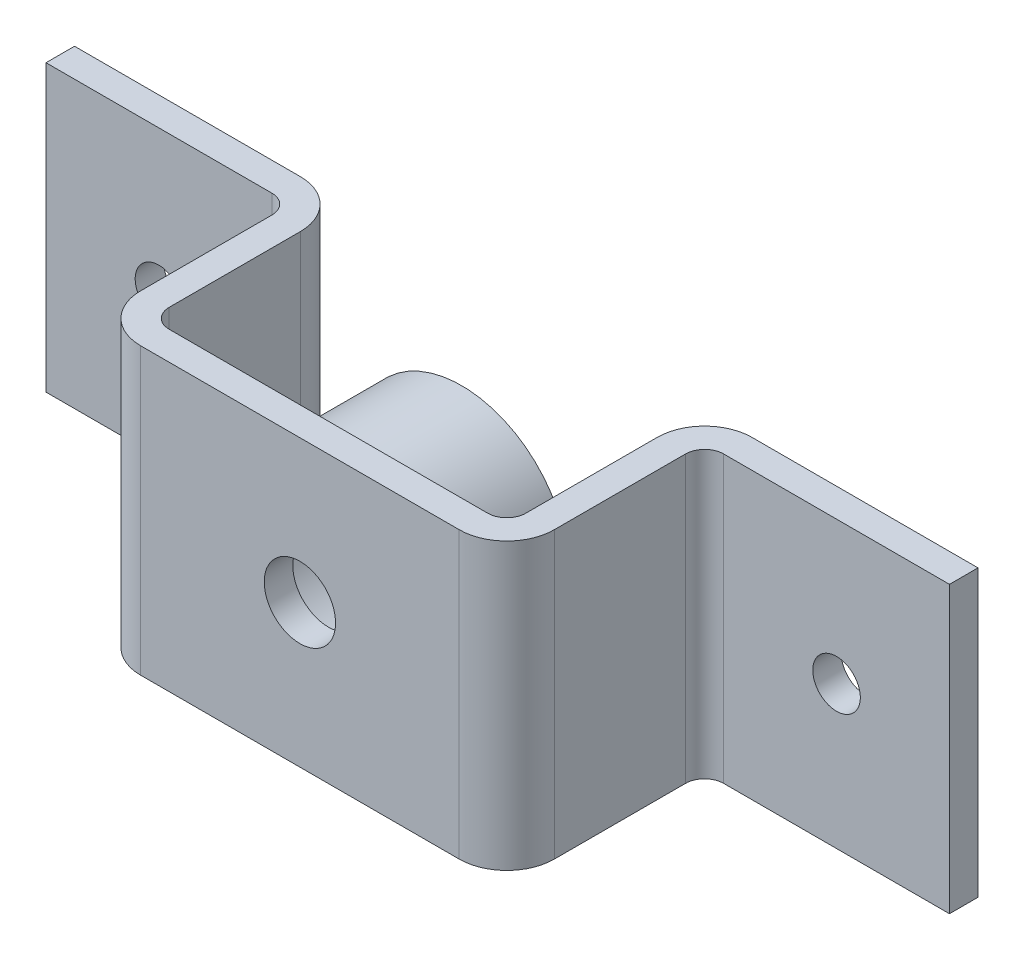
ISO-10303-21;
HEADER;
FILE_DESCRIPTION(('STEP AP214'),'2;1');
FILE_NAME('part.step','',(''),(''),'','','');
FILE_SCHEMA(('AUTOMOTIVE_DESIGN { 1 0 10303 214 1 1 1 1 }'));
ENDSEC;
DATA;
#1=APPLICATION_CONTEXT('core data for automotive mechanical design processes');
#2=APPLICATION_PROTOCOL_DEFINITION('international standard','automotive_design',2000,#1);
#3=PRODUCT_CONTEXT('',#1,'mechanical');
#4=PRODUCT('Part','Part','',(#3));
#5=PRODUCT_RELATED_PRODUCT_CATEGORY('part','',(#4));
#6=PRODUCT_DEFINITION_FORMATION('','',#4);
#7=PRODUCT_DEFINITION_CONTEXT('part definition',#1,'design');
#8=PRODUCT_DEFINITION('design','',#6,#7);
#9=PRODUCT_DEFINITION_SHAPE('','',#8);
#10=(LENGTH_UNIT() NAMED_UNIT(*) SI_UNIT(.MILLI.,.METRE.));
#11=(NAMED_UNIT(*) PLANE_ANGLE_UNIT() SI_UNIT($,.RADIAN.));
#12=(NAMED_UNIT(*) SI_UNIT($,.STERADIAN.) SOLID_ANGLE_UNIT());
#13=UNCERTAINTY_MEASURE_WITH_UNIT(LENGTH_MEASURE(1.E-05),#10,'distance_accuracy_value','');
#14=(GEOMETRIC_REPRESENTATION_CONTEXT(3) GLOBAL_UNCERTAINTY_ASSIGNED_CONTEXT((#13)) GLOBAL_UNIT_ASSIGNED_CONTEXT((#10,
#11,#12)) REPRESENTATION_CONTEXT('',''));
#15=CARTESIAN_POINT('',(0.,0.,0.));
#16=DIRECTION('',(0.,0.,1.));
#17=DIRECTION('',(1.,0.,0.));
#18=AXIS2_PLACEMENT_3D('',#15,#16,#17);
#19=CARTESIAN_POINT('',(0.,0.,-238.));
#20=DIRECTION('',(0.,0.,-1.));
#21=DIRECTION('',(-1.,0.,0.));
#22=AXIS2_PLACEMENT_3D('',#19,#20,#21);
#23=PLANE('',#22);
#24=CARTESIAN_POINT('',(356.25,0.,-238.));
#25=DIRECTION('',(0.,0.,-1.));
#26=DIRECTION('',(-1.,0.,0.));
#27=AXIS2_PLACEMENT_3D('',#24,#25,#26);
#28=CIRCLE('',#27,25.);
#29=CARTESIAN_POINT('',(331.25,0.,-238.));
#30=VERTEX_POINT('',#29);
#31=EDGE_CURVE('E290',#30,#30,#28,.T.);
#32=ORIENTED_EDGE('',*,*,#31,.F.);
#33=EDGE_LOOP('',(#32));
#34=FACE_BOUND('',#33,.T.);
#35=DIRECTION('',(1.,0.,0.));
#36=VECTOR('',#35,1.);
#37=CARTESIAN_POINT('',(-475.,-150.,-238.));
#38=LINE('',#37,#36);
#39=CARTESIAN_POINT('',(237.5,-150.,-238.));
#40=VERTEX_POINT('',#39);
#41=CARTESIAN_POINT('',(475.,-150.,-238.));
#42=VERTEX_POINT('',#41);
#43=EDGE_CURVE('E353',#40,#42,#38,.T.);
#44=ORIENTED_EDGE('',*,*,#43,.F.);
#45=DIRECTION('',(0.,-1.,0.));
#46=VECTOR('',#45,1.);
#47=CARTESIAN_POINT('',(237.5,150.,-238.));
#48=LINE('',#47,#46);
#49=CARTESIAN_POINT('',(237.5,150.,-238.));
#50=VERTEX_POINT('',#49);
#51=EDGE_CURVE('E283',#40,#50,#48,.F.);
#52=ORIENTED_EDGE('',*,*,#51,.T.);
#53=DIRECTION('',(-1.,0.,0.));
#54=VECTOR('',#53,1.);
#55=CARTESIAN_POINT('',(-475.,150.,-238.));
#56=LINE('',#55,#54);
#57=CARTESIAN_POINT('',(475.,150.,-238.));
#58=VERTEX_POINT('',#57);
#59=EDGE_CURVE('E349',#58,#50,#56,.T.);
#60=ORIENTED_EDGE('',*,*,#59,.F.);
#61=DIRECTION('',(0.,1.,0.));
#62=VECTOR('',#61,1.);
#63=CARTESIAN_POINT('',(475.,-150.,-238.));
#64=LINE('',#63,#62);
#65=EDGE_CURVE('E344',#42,#58,#64,.T.);
#66=ORIENTED_EDGE('',*,*,#65,.F.);
#67=EDGE_LOOP('',(#44,#52,#60,#66));
#68=FACE_BOUND('',#67,.T.);
#69=ADVANCED_FACE('F33',(#34,#68),#23,.T.);
#70=CARTESIAN_POINT('',(475.,-150.,-238.));
#71=DIRECTION('',(1.,0.,0.));
#72=DIRECTION('',(0.,0.,-1.));
#73=AXIS2_PLACEMENT_3D('',#70,#71,#72);
#74=PLANE('',#73);
#75=DIRECTION('',(0.,-1.,0.));
#76=VECTOR('',#75,1.);
#77=CARTESIAN_POINT('',(475.,155.,-208.));
#78=LINE('',#77,#76);
#79=CARTESIAN_POINT('',(475.,150.,-208.));
#80=VERTEX_POINT('',#79);
#81=CARTESIAN_POINT('',(475.,-150.,-208.));
#82=VERTEX_POINT('',#81);
#83=EDGE_CURVE('E321',#80,#82,#78,.T.);
#84=ORIENTED_EDGE('',*,*,#83,.T.);
#85=DIRECTION('',(0.,0.,1.));
#86=VECTOR('',#85,1.);
#87=CARTESIAN_POINT('',(475.,-150.,-238.));
#88=LINE('',#87,#86);
#89=EDGE_CURVE('E200',#42,#82,#88,.T.);
#90=ORIENTED_EDGE('',*,*,#89,.F.);
#91=ORIENTED_EDGE('',*,*,#65,.T.);
#92=DIRECTION('',(0.,0.,1.));
#93=VECTOR('',#92,1.);
#94=CARTESIAN_POINT('',(475.,150.,-238.));
#95=LINE('',#94,#93);
#96=EDGE_CURVE('E206',#58,#80,#95,.T.);
#97=ORIENTED_EDGE('',*,*,#96,.T.);
#98=EDGE_LOOP('',(#84,#90,#91,#97));
#99=FACE_BOUND('',#98,.T.);
#100=ADVANCED_FACE('F383',(#99),#74,.T.);
#101=CARTESIAN_POINT('',(-475.,-150.,-238.));
#102=DIRECTION('',(0.,-1.,0.));
#103=DIRECTION('',(0.,0.,-1.));
#104=AXIS2_PLACEMENT_3D('',#101,#102,#103);
#105=PLANE('',#104);
#106=DIRECTION('',(1.,0.,0.));
#107=VECTOR('',#106,1.);
#108=CARTESIAN_POINT('',(-475.,-150.,0.));
#109=LINE('',#108,#107);
#110=CARTESIAN_POINT('',(-167.5,-150.,0.));
#111=VERTEX_POINT('',#110);
#112=CARTESIAN_POINT('',(167.5,-150.,0.));
#113=VERTEX_POINT('',#112);
#114=EDGE_CURVE('E348',#111,#113,#109,.T.);
#115=ORIENTED_EDGE('',*,*,#114,.F.);
#116=CARTESIAN_POINT('',(-167.5,-150.,-50.));
#117=DIRECTION('',(0.,-1.,0.));
#118=DIRECTION('',(0.,0.,-1.));
#119=AXIS2_PLACEMENT_3D('',#116,#117,#118);
#120=CIRCLE('',#119,50.);
#121=CARTESIAN_POINT('',(-217.5,-150.,-50.));
#122=VERTEX_POINT('',#121);
#123=EDGE_CURVE('E267',#111,#122,#120,.T.);
#124=ORIENTED_EDGE('',*,*,#123,.T.);
#125=DIRECTION('',(0.,0.,1.));
#126=VECTOR('',#125,1.);
#127=CARTESIAN_POINT('',(-217.5,-150.,0.));
#128=LINE('',#127,#126);
#129=CARTESIAN_POINT('',(-217.5,-150.,-188.));
#130=VERTEX_POINT('',#129);
#131=EDGE_CURVE('E184',#130,#122,#128,.T.);
#132=ORIENTED_EDGE('',*,*,#131,.F.);
#133=CARTESIAN_POINT('',(-237.5,-150.,-188.));
#134=DIRECTION('',(0.,-1.,0.));
#135=DIRECTION('',(0.,0.,-1.));
#136=AXIS2_PLACEMENT_3D('',#133,#134,#135);
#137=CIRCLE('',#136,20.);
#138=CARTESIAN_POINT('',(-237.5,-150.,-208.));
#139=VERTEX_POINT('',#138);
#140=EDGE_CURVE('E193',#130,#139,#137,.F.);
#141=ORIENTED_EDGE('',*,*,#140,.T.);
#142=DIRECTION('',(1.,0.,0.));
#143=VECTOR('',#142,1.);
#144=CARTESIAN_POINT('',(-475.,-150.,-208.));
#145=LINE('',#144,#143);
#146=CARTESIAN_POINT('',(-475.,-150.,-208.));
#147=VERTEX_POINT('',#146);
#148=EDGE_CURVE('E175',#147,#139,#145,.T.);
#149=ORIENTED_EDGE('',*,*,#148,.F.);
#150=DIRECTION('',(0.,0.,1.));
#151=VECTOR('',#150,1.);
#152=CARTESIAN_POINT('',(-475.,-150.,-238.));
#153=LINE('',#152,#151);
#154=CARTESIAN_POINT('',(-475.,-150.,-238.));
#155=VERTEX_POINT('',#154);
#156=EDGE_CURVE('E190',#155,#147,#153,.T.);
#157=ORIENTED_EDGE('',*,*,#156,.F.);
#158=CARTESIAN_POINT('',(-237.5,-150.,-238.));
#159=VERTEX_POINT('',#158);
#160=EDGE_CURVE('E212',#155,#159,#38,.T.);
#161=ORIENTED_EDGE('',*,*,#160,.T.);
#162=CARTESIAN_POINT('',(-237.5,-150.,-188.));
#163=DIRECTION('',(0.,-1.,0.));
#164=DIRECTION('',(0.,0.,-1.));
#165=AXIS2_PLACEMENT_3D('',#162,#163,#164);
#166=CIRCLE('',#165,50.);
#167=CARTESIAN_POINT('',(-187.5,-150.,-188.));
#168=VERTEX_POINT('',#167);
#169=EDGE_CURVE('E261',#159,#168,#166,.T.);
#170=ORIENTED_EDGE('',*,*,#169,.T.);
#171=DIRECTION('',(0.,0.,-1.));
#172=VECTOR('',#171,1.);
#173=CARTESIAN_POINT('',(-187.5,-150.,-238.));
#174=LINE('',#173,#172);
#175=CARTESIAN_POINT('',(-187.5,-150.,-50.));
#176=VERTEX_POINT('',#175);
#177=EDGE_CURVE('E335',#176,#168,#174,.T.);
#178=ORIENTED_EDGE('',*,*,#177,.F.);
#179=CARTESIAN_POINT('',(-167.5,-150.,-50.));
#180=DIRECTION('',(0.,-1.,0.));
#181=DIRECTION('',(0.,0.,-1.));
#182=AXIS2_PLACEMENT_3D('',#179,#180,#181);
#183=CIRCLE('',#182,20.);
#184=CARTESIAN_POINT('',(-167.5,-150.,-30.));
#185=VERTEX_POINT('',#184);
#186=EDGE_CURVE('E253',#176,#185,#183,.F.);
#187=ORIENTED_EDGE('',*,*,#186,.T.);
#188=DIRECTION('',(-1.,0.,0.));
#189=VECTOR('',#188,1.);
#190=CARTESIAN_POINT('',(-475.,-150.,-30.));
#191=LINE('',#190,#189);
#192=CARTESIAN_POINT('',(167.5,-150.,-30.));
#193=VERTEX_POINT('',#192);
#194=EDGE_CURVE('E340',#193,#185,#191,.T.);
#195=ORIENTED_EDGE('',*,*,#194,.F.);
#196=CARTESIAN_POINT('',(167.5,-150.,-50.));
#197=DIRECTION('',(0.,-1.,0.));
#198=DIRECTION('',(0.,0.,-1.));
#199=AXIS2_PLACEMENT_3D('',#196,#197,#198);
#200=CIRCLE('',#199,20.);
#201=CARTESIAN_POINT('',(187.5,-150.,-50.));
#202=VERTEX_POINT('',#201);
#203=EDGE_CURVE('E247',#193,#202,#200,.F.);
#204=ORIENTED_EDGE('',*,*,#203,.T.);
#205=DIRECTION('',(0.,0.,1.));
#206=VECTOR('',#205,1.);
#207=CARTESIAN_POINT('',(187.5,-150.,-238.));
#208=LINE('',#207,#206);
#209=CARTESIAN_POINT('',(187.5,-150.,-188.));
#210=VERTEX_POINT('',#209);
#211=EDGE_CURVE('E338',#210,#202,#208,.T.);
#212=ORIENTED_EDGE('',*,*,#211,.F.);
#213=CARTESIAN_POINT('',(237.5,-150.,-188.));
#214=DIRECTION('',(0.,-1.,0.));
#215=DIRECTION('',(0.,0.,-1.));
#216=AXIS2_PLACEMENT_3D('',#213,#214,#215);
#217=CIRCLE('',#216,50.);
#218=EDGE_CURVE('E263',#210,#40,#217,.T.);
#219=ORIENTED_EDGE('',*,*,#218,.T.);
#220=ORIENTED_EDGE('',*,*,#43,.T.);
#221=ORIENTED_EDGE('',*,*,#89,.T.);
#222=DIRECTION('',(1.,0.,0.));
#223=VECTOR('',#222,1.);
#224=CARTESIAN_POINT('',(475.,-150.,-208.));
#225=LINE('',#224,#223);
#226=CARTESIAN_POINT('',(237.5,-150.,-208.));
#227=VERTEX_POINT('',#226);
#228=EDGE_CURVE('E319',#227,#82,#225,.T.);
#229=ORIENTED_EDGE('',*,*,#228,.F.);
#230=CARTESIAN_POINT('',(237.5,-150.,-188.));
#231=DIRECTION('',(0.,-1.,0.));
#232=DIRECTION('',(0.,0.,-1.));
#233=AXIS2_PLACEMENT_3D('',#230,#231,#232);
#234=CIRCLE('',#233,20.);
#235=CARTESIAN_POINT('',(217.5,-150.,-188.));
#236=VERTEX_POINT('',#235);
#237=EDGE_CURVE('E236',#227,#236,#234,.F.);
#238=ORIENTED_EDGE('',*,*,#237,.T.);
#239=DIRECTION('',(0.,0.,-1.));
#240=VECTOR('',#239,1.);
#241=CARTESIAN_POINT('',(217.5,-150.,0.));
#242=LINE('',#241,#240);
#243=CARTESIAN_POINT('',(217.5,-150.,-50.));
#244=VERTEX_POINT('',#243);
#245=EDGE_CURVE('E317',#244,#236,#242,.T.);
#246=ORIENTED_EDGE('',*,*,#245,.F.);
#247=CARTESIAN_POINT('',(167.5,-150.,-50.));
#248=DIRECTION('',(0.,-1.,0.));
#249=DIRECTION('',(0.,0.,-1.));
#250=AXIS2_PLACEMENT_3D('',#247,#248,#249);
#251=CIRCLE('',#250,50.);
#252=EDGE_CURVE('E265',#244,#113,#251,.T.);
#253=ORIENTED_EDGE('',*,*,#252,.T.);
#254=EDGE_LOOP('',(#115,#124,#132,#141,#149,#157,#161,#170,#178,#187,#195,#204,#212,#219,#220,
#221,#229,#238,#246,#253));
#255=FACE_BOUND('',#254,.T.);
#256=ADVANCED_FACE('F188',(#255),#105,.T.);
#257=CARTESIAN_POINT('',(-475.,-150.,-238.));
#258=DIRECTION('',(-1.,0.,0.));
#259=DIRECTION('',(0.,0.,1.));
#260=AXIS2_PLACEMENT_3D('',#257,#258,#259);
#261=PLANE('',#260);
#262=DIRECTION('',(0.,-1.,0.));
#263=VECTOR('',#262,1.);
#264=CARTESIAN_POINT('',(-475.,155.,-208.));
#265=LINE('',#264,#263);
#266=CARTESIAN_POINT('',(-475.,150.,-208.));
#267=VERTEX_POINT('',#266);
#268=EDGE_CURVE('E172',#267,#147,#265,.T.);
#269=ORIENTED_EDGE('',*,*,#268,.F.);
#270=DIRECTION('',(0.,0.,1.));
#271=VECTOR('',#270,1.);
#272=CARTESIAN_POINT('',(-475.,150.,-238.));
#273=LINE('',#272,#271);
#274=CARTESIAN_POINT('',(-475.,150.,-238.));
#275=VERTEX_POINT('',#274);
#276=EDGE_CURVE('E201',#275,#267,#273,.T.);
#277=ORIENTED_EDGE('',*,*,#276,.F.);
#278=DIRECTION('',(0.,-1.,0.));
#279=VECTOR('',#278,1.);
#280=CARTESIAN_POINT('',(-475.,-150.,-238.));
#281=LINE('',#280,#279);
#282=EDGE_CURVE('E198',#275,#155,#281,.T.);
#283=ORIENTED_EDGE('',*,*,#282,.T.);
#284=ORIENTED_EDGE('',*,*,#156,.T.);
#285=EDGE_LOOP('',(#269,#277,#283,#284));
#286=FACE_BOUND('',#285,.T.);
#287=ADVANCED_FACE('F196',(#286),#261,.T.);
#288=CARTESIAN_POINT('',(-475.,150.,-238.));
#289=DIRECTION('',(0.,1.,0.));
#290=DIRECTION('',(0.,0.,1.));
#291=AXIS2_PLACEMENT_3D('',#288,#289,#290);
#292=PLANE('',#291);
#293=DIRECTION('',(0.,0.,-1.));
#294=VECTOR('',#293,1.);
#295=CARTESIAN_POINT('',(-217.5,150.,-238.));
#296=LINE('',#295,#294);
#297=CARTESIAN_POINT('',(-217.5,150.,-50.));
#298=VERTEX_POINT('',#297);
#299=CARTESIAN_POINT('',(-217.5,150.,-188.));
#300=VERTEX_POINT('',#299);
#301=EDGE_CURVE('E183',#298,#300,#296,.T.);
#302=ORIENTED_EDGE('',*,*,#301,.F.);
#303=CARTESIAN_POINT('',(-167.5,150.,-50.));
#304=DIRECTION('',(0.,1.,0.));
#305=DIRECTION('',(0.,0.,1.));
#306=AXIS2_PLACEMENT_3D('',#303,#304,#305);
#307=CIRCLE('',#306,50.);
#308=CARTESIAN_POINT('',(-167.5,150.,0.));
#309=VERTEX_POINT('',#308);
#310=EDGE_CURVE('E276',#298,#309,#307,.T.);
#311=ORIENTED_EDGE('',*,*,#310,.T.);
#312=DIRECTION('',(-1.,0.,0.));
#313=VECTOR('',#312,1.);
#314=CARTESIAN_POINT('',(-475.,150.,0.));
#315=LINE('',#314,#313);
#316=CARTESIAN_POINT('',(167.5,150.,0.));
#317=VERTEX_POINT('',#316);
#318=EDGE_CURVE('E343',#317,#309,#315,.T.);
#319=ORIENTED_EDGE('',*,*,#318,.F.);
#320=CARTESIAN_POINT('',(167.5,150.,-50.));
#321=DIRECTION('',(0.,1.,0.));
#322=DIRECTION('',(0.,0.,1.));
#323=AXIS2_PLACEMENT_3D('',#320,#321,#322);
#324=CIRCLE('',#323,50.);
#325=CARTESIAN_POINT('',(217.5,150.,-50.));
#326=VERTEX_POINT('',#325);
#327=EDGE_CURVE('E274',#317,#326,#324,.T.);
#328=ORIENTED_EDGE('',*,*,#327,.T.);
#329=DIRECTION('',(0.,0.,1.));
#330=VECTOR('',#329,1.);
#331=CARTESIAN_POINT('',(217.5,150.,-238.));
#332=LINE('',#331,#330);
#333=CARTESIAN_POINT('',(217.5,150.,-188.));
#334=VERTEX_POINT('',#333);
#335=EDGE_CURVE('E324',#334,#326,#332,.T.);
#336=ORIENTED_EDGE('',*,*,#335,.F.);
#337=CARTESIAN_POINT('',(237.5,150.,-188.));
#338=DIRECTION('',(0.,1.,0.));
#339=DIRECTION('',(0.,0.,1.));
#340=AXIS2_PLACEMENT_3D('',#337,#338,#339);
#341=CIRCLE('',#340,20.);
#342=CARTESIAN_POINT('',(237.5,150.,-208.));
#343=VERTEX_POINT('',#342);
#344=EDGE_CURVE('E239',#334,#343,#341,.F.);
#345=ORIENTED_EDGE('',*,*,#344,.T.);
#346=DIRECTION('',(-1.,0.,0.));
#347=VECTOR('',#346,1.);
#348=CARTESIAN_POINT('',(-475.,150.,-208.));
#349=LINE('',#348,#347);
#350=EDGE_CURVE('E204',#80,#343,#349,.T.);
#351=ORIENTED_EDGE('',*,*,#350,.F.);
#352=ORIENTED_EDGE('',*,*,#96,.F.);
#353=ORIENTED_EDGE('',*,*,#59,.T.);
#354=CARTESIAN_POINT('',(237.5,150.,-188.));
#355=DIRECTION('',(0.,1.,0.));
#356=DIRECTION('',(0.,0.,1.));
#357=AXIS2_PLACEMENT_3D('',#354,#355,#356);
#358=CIRCLE('',#357,50.);
#359=CARTESIAN_POINT('',(187.5,150.,-188.));
#360=VERTEX_POINT('',#359);
#361=EDGE_CURVE('E272',#50,#360,#358,.T.);
#362=ORIENTED_EDGE('',*,*,#361,.T.);
#363=DIRECTION('',(0.,0.,-1.));
#364=VECTOR('',#363,1.);
#365=CARTESIAN_POINT('',(187.5,150.,-238.));
#366=LINE('',#365,#364);
#367=CARTESIAN_POINT('',(187.5,150.,-50.));
#368=VERTEX_POINT('',#367);
#369=EDGE_CURVE('E327',#368,#360,#366,.T.);
#370=ORIENTED_EDGE('',*,*,#369,.F.);
#371=CARTESIAN_POINT('',(167.5,150.,-50.));
#372=DIRECTION('',(0.,1.,0.));
#373=DIRECTION('',(0.,0.,1.));
#374=AXIS2_PLACEMENT_3D('',#371,#372,#373);
#375=CIRCLE('',#374,20.);
#376=CARTESIAN_POINT('',(167.5,150.,-30.));
#377=VERTEX_POINT('',#376);
#378=EDGE_CURVE('E245',#368,#377,#375,.F.);
#379=ORIENTED_EDGE('',*,*,#378,.T.);
#380=DIRECTION('',(1.,0.,0.));
#381=VECTOR('',#380,1.);
#382=CARTESIAN_POINT('',(187.5,150.,-30.));
#383=LINE('',#382,#381);
#384=CARTESIAN_POINT('',(-167.5,150.,-30.));
#385=VERTEX_POINT('',#384);
#386=EDGE_CURVE('E332',#385,#377,#383,.T.);
#387=ORIENTED_EDGE('',*,*,#386,.F.);
#388=CARTESIAN_POINT('',(-167.5,150.,-50.));
#389=DIRECTION('',(0.,1.,0.));
#390=DIRECTION('',(0.,0.,1.));
#391=AXIS2_PLACEMENT_3D('',#388,#389,#390);
#392=CIRCLE('',#391,20.);
#393=CARTESIAN_POINT('',(-187.5,150.,-50.));
#394=VERTEX_POINT('',#393);
#395=EDGE_CURVE('E250',#385,#394,#392,.F.);
#396=ORIENTED_EDGE('',*,*,#395,.T.);
#397=DIRECTION('',(0.,0.,1.));
#398=VECTOR('',#397,1.);
#399=CARTESIAN_POINT('',(-187.5,150.,-238.));
#400=LINE('',#399,#398);
#401=CARTESIAN_POINT('',(-187.5,150.,-188.));
#402=VERTEX_POINT('',#401);
#403=EDGE_CURVE('E330',#402,#394,#400,.T.);
#404=ORIENTED_EDGE('',*,*,#403,.F.);
#405=CARTESIAN_POINT('',(-237.5,150.,-188.));
#406=DIRECTION('',(0.,1.,0.));
#407=DIRECTION('',(0.,0.,1.));
#408=AXIS2_PLACEMENT_3D('',#405,#406,#407);
#409=CIRCLE('',#408,50.);
#410=CARTESIAN_POINT('',(-237.5,150.,-238.));
#411=VERTEX_POINT('',#410);
#412=EDGE_CURVE('E50',#402,#411,#409,.T.);
#413=ORIENTED_EDGE('',*,*,#412,.T.);
#414=EDGE_CURVE('E347',#411,#275,#56,.T.);
#415=ORIENTED_EDGE('',*,*,#414,.T.);
#416=ORIENTED_EDGE('',*,*,#276,.T.);
#417=DIRECTION('',(-1.,0.,0.));
#418=VECTOR('',#417,1.);
#419=CARTESIAN_POINT('',(-475.,150.,-208.));
#420=LINE('',#419,#418);
#421=CARTESIAN_POINT('',(-237.5,150.,-208.));
#422=VERTEX_POINT('',#421);
#423=EDGE_CURVE('E178',#422,#267,#420,.T.);
#424=ORIENTED_EDGE('',*,*,#423,.F.);
#425=CARTESIAN_POINT('',(-237.5,150.,-188.));
#426=DIRECTION('',(0.,1.,0.));
#427=DIRECTION('',(0.,0.,1.));
#428=AXIS2_PLACEMENT_3D('',#425,#426,#427);
#429=CIRCLE('',#428,20.);
#430=EDGE_CURVE('E242',#422,#300,#429,.F.);
#431=ORIENTED_EDGE('',*,*,#430,.T.);
#432=EDGE_LOOP('',(#302,#311,#319,#328,#336,#345,#351,#352,#353,#362,#370,#379,#387,#396,#404,
#413,#415,#416,#424,#431));
#433=FACE_BOUND('',#432,.T.);
#434=ADVANCED_FACE('F368',(#433),#292,.T.);
#435=CARTESIAN_POINT('',(-356.25,0.,-238.));
#436=DIRECTION('',(0.,0.,1.));
#437=DIRECTION('',(1.,0.,0.));
#438=AXIS2_PLACEMENT_3D('',#435,#436,#437);
#439=CIRCLE('',#438,25.);
#440=CARTESIAN_POINT('',(-331.25,0.,-238.));
#441=VERTEX_POINT('',#440);
#442=EDGE_CURVE('E301',#441,#441,#439,.T.);
#443=ORIENTED_EDGE('',*,*,#442,.T.);
#444=EDGE_LOOP('',(#443));
#445=FACE_BOUND('',#444,.T.);
#446=ORIENTED_EDGE('',*,*,#414,.F.);
#447=DIRECTION('',(0.,1.,0.));
#448=VECTOR('',#447,1.);
#449=CARTESIAN_POINT('',(-237.5,-150.,-238.));
#450=LINE('',#449,#448);
#451=EDGE_CURVE('E42',#411,#159,#450,.F.);
#452=ORIENTED_EDGE('',*,*,#451,.T.);
#453=ORIENTED_EDGE('',*,*,#160,.F.);
#454=ORIENTED_EDGE('',*,*,#282,.F.);
#455=EDGE_LOOP('',(#446,#452,#453,#454));
#456=FACE_BOUND('',#455,.T.);
#457=ADVANCED_FACE('F416',(#445,#456),#23,.T.);
#458=CARTESIAN_POINT('',(0.,0.,0.));
#459=DIRECTION('',(0.,0.,-1.));
#460=DIRECTION('',(-1.,0.,0.));
#461=AXIS2_PLACEMENT_3D('',#458,#459,#460);
#462=PLANE('',#461);
#463=CARTESIAN_POINT('',(0.,0.,0.));
#464=DIRECTION('',(0.,0.,-1.));
#465=DIRECTION('',(-1.,0.,0.));
#466=AXIS2_PLACEMENT_3D('',#463,#464,#465);
#467=CIRCLE('',#466,37.5);
#468=CARTESIAN_POINT('',(-37.5,0.,0.));
#469=VERTEX_POINT('',#468);
#470=EDGE_CURVE('E294',#469,#469,#467,.T.);
#471=ORIENTED_EDGE('',*,*,#470,.T.);
#472=EDGE_LOOP('',(#471));
#473=FACE_BOUND('',#472,.T.);
#474=ORIENTED_EDGE('',*,*,#318,.T.);
#475=DIRECTION('',(0.,-1.,0.));
#476=VECTOR('',#475,1.);
#477=CARTESIAN_POINT('',(-167.5,0.,0.));
#478=LINE('',#477,#476);
#479=EDGE_CURVE('E258',#309,#111,#478,.T.);
#480=ORIENTED_EDGE('',*,*,#479,.T.);
#481=ORIENTED_EDGE('',*,*,#114,.T.);
#482=DIRECTION('',(0.,1.,0.));
#483=VECTOR('',#482,1.);
#484=CARTESIAN_POINT('',(167.5,0.,0.));
#485=LINE('',#484,#483);
#486=EDGE_CURVE('E255',#113,#317,#485,.T.);
#487=ORIENTED_EDGE('',*,*,#486,.T.);
#488=EDGE_LOOP('',(#474,#480,#481,#487));
#489=FACE_BOUND('',#488,.T.);
#490=ADVANCED_FACE('F359',(#473,#489),#462,.F.);
#491=CARTESIAN_POINT('',(187.5,-155.,-238.));
#492=DIRECTION('',(1.,0.,0.));
#493=DIRECTION('',(0.,0.,-1.));
#494=AXIS2_PLACEMENT_3D('',#491,#492,#493);
#495=PLANE('',#494);
#496=ORIENTED_EDGE('',*,*,#369,.T.);
#497=DIRECTION('',(0.,-1.,0.));
#498=VECTOR('',#497,1.);
#499=CARTESIAN_POINT('',(187.5,-150.,-188.));
#500=LINE('',#499,#498);
#501=EDGE_CURVE('E280',#360,#210,#500,.T.);
#502=ORIENTED_EDGE('',*,*,#501,.T.);
#503=ORIENTED_EDGE('',*,*,#211,.T.);
#504=DIRECTION('',(0.,1.,0.));
#505=VECTOR('',#504,1.);
#506=CARTESIAN_POINT('',(187.5,150.,-50.));
#507=LINE('',#506,#505);
#508=EDGE_CURVE('E226',#202,#368,#507,.T.);
#509=ORIENTED_EDGE('',*,*,#508,.T.);
#510=EDGE_LOOP('',(#496,#502,#503,#509));
#511=FACE_BOUND('',#510,.T.);
#512=ADVANCED_FACE('F396',(#511),#495,.F.);
#513=CARTESIAN_POINT('',(187.5,-155.,-30.));
#514=DIRECTION('',(0.,0.,1.));
#515=DIRECTION('',(1.,0.,0.));
#516=AXIS2_PLACEMENT_3D('',#513,#514,#515);
#517=PLANE('',#516);
#518=CARTESIAN_POINT('',(0.,0.,-30.));
#519=DIRECTION('',(0.,0.,1.));
#520=DIRECTION('',(1.,0.,0.));
#521=AXIS2_PLACEMENT_3D('',#518,#519,#520);
#522=CIRCLE('',#521,112.5);
#523=CARTESIAN_POINT('',(112.5,0.,-30.));
#524=VERTEX_POINT('',#523);
#525=EDGE_CURVE('E11',#524,#524,#522,.F.);
#526=ORIENTED_EDGE('',*,*,#525,.F.);
#527=EDGE_LOOP('',(#526));
#528=FACE_BOUND('',#527,.T.);
#529=ORIENTED_EDGE('',*,*,#386,.T.);
#530=DIRECTION('',(0.,1.,0.));
#531=VECTOR('',#530,1.);
#532=CARTESIAN_POINT('',(167.5,-150.,-30.));
#533=LINE('',#532,#531);
#534=EDGE_CURVE('E232',#377,#193,#533,.F.);
#535=ORIENTED_EDGE('',*,*,#534,.T.);
#536=ORIENTED_EDGE('',*,*,#194,.T.);
#537=DIRECTION('',(0.,1.,0.));
#538=VECTOR('',#537,1.);
#539=CARTESIAN_POINT('',(-167.5,150.,-30.));
#540=LINE('',#539,#538);
#541=EDGE_CURVE('E229',#185,#385,#540,.T.);
#542=ORIENTED_EDGE('',*,*,#541,.T.);
#543=EDGE_LOOP('',(#529,#535,#536,#542));
#544=FACE_BOUND('',#543,.T.);
#545=ADVANCED_FACE('F404',(#528,#544),#517,.F.);
#546=CARTESIAN_POINT('',(-187.5,-155.,-238.));
#547=DIRECTION('',(-1.,0.,0.));
#548=DIRECTION('',(0.,0.,1.));
#549=AXIS2_PLACEMENT_3D('',#546,#547,#548);
#550=PLANE('',#549);
#551=ORIENTED_EDGE('',*,*,#177,.T.);
#552=DIRECTION('',(0.,1.,0.));
#553=VECTOR('',#552,1.);
#554=CARTESIAN_POINT('',(-187.5,150.,-188.));
#555=LINE('',#554,#553);
#556=EDGE_CURVE('E285',#168,#402,#555,.T.);
#557=ORIENTED_EDGE('',*,*,#556,.T.);
#558=ORIENTED_EDGE('',*,*,#403,.T.);
#559=DIRECTION('',(0.,1.,0.));
#560=VECTOR('',#559,1.);
#561=CARTESIAN_POINT('',(-187.5,-150.,-50.));
#562=LINE('',#561,#560);
#563=EDGE_CURVE('E234',#394,#176,#562,.F.);
#564=ORIENTED_EDGE('',*,*,#563,.T.);
#565=EDGE_LOOP('',(#551,#557,#558,#564));
#566=FACE_BOUND('',#565,.T.);
#567=ADVANCED_FACE('F412',(#566),#550,.F.);
#568=CARTESIAN_POINT('',(475.,155.,-208.));
#569=DIRECTION('',(0.,0.,-1.));
#570=DIRECTION('',(-1.,0.,0.));
#571=AXIS2_PLACEMENT_3D('',#568,#569,#570);
#572=PLANE('',#571);
#573=CARTESIAN_POINT('',(356.25,0.,-208.));
#574=DIRECTION('',(0.,0.,-1.));
#575=DIRECTION('',(-1.,0.,0.));
#576=AXIS2_PLACEMENT_3D('',#573,#574,#575);
#577=CIRCLE('',#576,25.);
#578=CARTESIAN_POINT('',(331.25,0.,-208.));
#579=VERTEX_POINT('',#578);
#580=EDGE_CURVE('E287',#579,#579,#577,.T.);
#581=ORIENTED_EDGE('',*,*,#580,.T.);
#582=EDGE_LOOP('',(#581));
#583=FACE_BOUND('',#582,.T.);
#584=ORIENTED_EDGE('',*,*,#350,.T.);
#585=DIRECTION('',(0.,-1.,0.));
#586=VECTOR('',#585,1.);
#587=CARTESIAN_POINT('',(237.5,-150.,-208.));
#588=LINE('',#587,#586);
#589=EDGE_CURVE('E216',#343,#227,#588,.T.);
#590=ORIENTED_EDGE('',*,*,#589,.T.);
#591=ORIENTED_EDGE('',*,*,#228,.T.);
#592=ORIENTED_EDGE('',*,*,#83,.F.);
#593=EDGE_LOOP('',(#584,#590,#591,#592));
#594=FACE_BOUND('',#593,.T.);
#595=ADVANCED_FACE('F379',(#583,#594),#572,.F.);
#596=CARTESIAN_POINT('',(217.5,155.,0.));
#597=DIRECTION('',(-1.,0.,0.));
#598=DIRECTION('',(0.,0.,1.));
#599=AXIS2_PLACEMENT_3D('',#596,#597,#598);
#600=PLANE('',#599);
#601=ORIENTED_EDGE('',*,*,#335,.T.);
#602=DIRECTION('',(0.,1.,0.));
#603=VECTOR('',#602,1.);
#604=CARTESIAN_POINT('',(217.5,155.,-50.));
#605=LINE('',#604,#603);
#606=EDGE_CURVE('E278',#326,#244,#605,.F.);
#607=ORIENTED_EDGE('',*,*,#606,.T.);
#608=ORIENTED_EDGE('',*,*,#245,.T.);
#609=DIRECTION('',(0.,-1.,0.));
#610=VECTOR('',#609,1.);
#611=CARTESIAN_POINT('',(217.5,150.,-188.));
#612=LINE('',#611,#610);
#613=EDGE_CURVE('E219',#236,#334,#612,.F.);
#614=ORIENTED_EDGE('',*,*,#613,.T.);
#615=EDGE_LOOP('',(#601,#607,#608,#614));
#616=FACE_BOUND('',#615,.T.);
#617=ADVANCED_FACE('F371',(#616),#600,.F.);
#618=CARTESIAN_POINT('',(-217.5,155.,0.));
#619=DIRECTION('',(1.,0.,0.));
#620=DIRECTION('',(0.,0.,-1.));
#621=AXIS2_PLACEMENT_3D('',#618,#619,#620);
#622=PLANE('',#621);
#623=ORIENTED_EDGE('',*,*,#131,.T.);
#624=DIRECTION('',(0.,-1.,0.));
#625=VECTOR('',#624,1.);
#626=CARTESIAN_POINT('',(-217.5,155.,-50.));
#627=LINE('',#626,#625);
#628=EDGE_CURVE('E269',#122,#298,#627,.F.);
#629=ORIENTED_EDGE('',*,*,#628,.T.);
#630=ORIENTED_EDGE('',*,*,#301,.T.);
#631=DIRECTION('',(0.,-1.,0.));
#632=VECTOR('',#631,1.);
#633=CARTESIAN_POINT('',(-217.5,-150.,-188.));
#634=LINE('',#633,#632);
#635=EDGE_CURVE('E221',#300,#130,#634,.T.);
#636=ORIENTED_EDGE('',*,*,#635,.T.);
#637=EDGE_LOOP('',(#623,#629,#630,#636));
#638=FACE_BOUND('',#637,.T.);
#639=ADVANCED_FACE('F422',(#638),#622,.F.);
#640=CARTESIAN_POINT('',(-475.,155.,-208.));
#641=DIRECTION('',(0.,0.,-1.));
#642=DIRECTION('',(-1.,0.,0.));
#643=AXIS2_PLACEMENT_3D('',#640,#641,#642);
#644=PLANE('',#643);
#645=CARTESIAN_POINT('',(-356.25,0.,-208.));
#646=DIRECTION('',(0.,0.,-1.));
#647=DIRECTION('',(-1.,0.,0.));
#648=AXIS2_PLACEMENT_3D('',#645,#646,#647);
#649=CIRCLE('',#648,25.);
#650=CARTESIAN_POINT('',(-381.25,0.,-208.));
#651=VERTEX_POINT('',#650);
#652=EDGE_CURVE('E37',#651,#651,#649,.F.);
#653=ORIENTED_EDGE('',*,*,#652,.F.);
#654=EDGE_LOOP('',(#653));
#655=FACE_BOUND('',#654,.T.);
#656=ORIENTED_EDGE('',*,*,#148,.T.);
#657=DIRECTION('',(0.,-1.,0.));
#658=VECTOR('',#657,1.);
#659=CARTESIAN_POINT('',(-237.5,150.,-208.));
#660=LINE('',#659,#658);
#661=EDGE_CURVE('E224',#139,#422,#660,.F.);
#662=ORIENTED_EDGE('',*,*,#661,.T.);
#663=ORIENTED_EDGE('',*,*,#423,.T.);
#664=ORIENTED_EDGE('',*,*,#268,.T.);
#665=EDGE_LOOP('',(#656,#662,#663,#664));
#666=FACE_BOUND('',#665,.T.);
#667=ADVANCED_FACE('F174',(#655,#666),#644,.F.);
#668=CARTESIAN_POINT('',(237.5,155.,-188.));
#669=DIRECTION('',(0.,1.,0.));
#670=DIRECTION('',(0.,0.,1.));
#671=AXIS2_PLACEMENT_3D('',#668,#669,#670);
#672=CYLINDRICAL_SURFACE('',#671,20.);
#673=ORIENTED_EDGE('',*,*,#344,.F.);
#674=ORIENTED_EDGE('',*,*,#613,.F.);
#675=ORIENTED_EDGE('',*,*,#237,.F.);
#676=ORIENTED_EDGE('',*,*,#589,.F.);
#677=EDGE_LOOP('',(#673,#674,#675,#676));
#678=FACE_BOUND('',#677,.T.);
#679=ADVANCED_FACE('F375',(#678),#672,.F.);
#680=CARTESIAN_POINT('',(-237.5,155.,-188.));
#681=DIRECTION('',(0.,1.,0.));
#682=DIRECTION('',(0.,0.,1.));
#683=AXIS2_PLACEMENT_3D('',#680,#681,#682);
#684=CYLINDRICAL_SURFACE('',#683,20.);
#685=ORIENTED_EDGE('',*,*,#430,.F.);
#686=ORIENTED_EDGE('',*,*,#661,.F.);
#687=ORIENTED_EDGE('',*,*,#140,.F.);
#688=ORIENTED_EDGE('',*,*,#635,.F.);
#689=EDGE_LOOP('',(#685,#686,#687,#688));
#690=FACE_BOUND('',#689,.T.);
#691=ADVANCED_FACE('F420',(#690),#684,.F.);
#692=CARTESIAN_POINT('',(167.5,-155.,-50.));
#693=DIRECTION('',(0.,-1.,0.));
#694=DIRECTION('',(0.,0.,-1.));
#695=AXIS2_PLACEMENT_3D('',#692,#693,#694);
#696=CYLINDRICAL_SURFACE('',#695,20.);
#697=ORIENTED_EDGE('',*,*,#203,.F.);
#698=ORIENTED_EDGE('',*,*,#534,.F.);
#699=ORIENTED_EDGE('',*,*,#378,.F.);
#700=ORIENTED_EDGE('',*,*,#508,.F.);
#701=EDGE_LOOP('',(#697,#698,#699,#700));
#702=FACE_BOUND('',#701,.T.);
#703=ADVANCED_FACE('F400',(#702),#696,.F.);
#704=CARTESIAN_POINT('',(-167.5,-155.,-50.));
#705=DIRECTION('',(0.,-1.,0.));
#706=DIRECTION('',(0.,0.,-1.));
#707=AXIS2_PLACEMENT_3D('',#704,#705,#706);
#708=CYLINDRICAL_SURFACE('',#707,20.);
#709=ORIENTED_EDGE('',*,*,#186,.F.);
#710=ORIENTED_EDGE('',*,*,#563,.F.);
#711=ORIENTED_EDGE('',*,*,#395,.F.);
#712=ORIENTED_EDGE('',*,*,#541,.F.);
#713=EDGE_LOOP('',(#709,#710,#711,#712));
#714=FACE_BOUND('',#713,.T.);
#715=ADVANCED_FACE('F409',(#714),#708,.F.);
#716=CARTESIAN_POINT('',(-167.5,0.,-50.));
#717=DIRECTION('',(0.,-1.,0.));
#718=DIRECTION('',(0.,0.,-1.));
#719=AXIS2_PLACEMENT_3D('',#716,#717,#718);
#720=CYLINDRICAL_SURFACE('',#719,50.);
#721=ORIENTED_EDGE('',*,*,#310,.F.);
#722=ORIENTED_EDGE('',*,*,#628,.F.);
#723=ORIENTED_EDGE('',*,*,#123,.F.);
#724=ORIENTED_EDGE('',*,*,#479,.F.);
#725=EDGE_LOOP('',(#721,#722,#723,#724));
#726=FACE_BOUND('',#725,.T.);
#727=ADVANCED_FACE('F426',(#726),#720,.T.);
#728=CARTESIAN_POINT('',(167.5,0.,-50.));
#729=DIRECTION('',(0.,1.,0.));
#730=DIRECTION('',(0.,0.,1.));
#731=AXIS2_PLACEMENT_3D('',#728,#729,#730);
#732=CYLINDRICAL_SURFACE('',#731,50.);
#733=ORIENTED_EDGE('',*,*,#252,.F.);
#734=ORIENTED_EDGE('',*,*,#606,.F.);
#735=ORIENTED_EDGE('',*,*,#327,.F.);
#736=ORIENTED_EDGE('',*,*,#486,.F.);
#737=EDGE_LOOP('',(#733,#734,#735,#736));
#738=FACE_BOUND('',#737,.T.);
#739=ADVANCED_FACE('F364',(#738),#732,.T.);
#740=CARTESIAN_POINT('',(237.5,-155.,-188.));
#741=DIRECTION('',(0.,1.,0.));
#742=DIRECTION('',(0.,0.,1.));
#743=AXIS2_PLACEMENT_3D('',#740,#741,#742);
#744=CYLINDRICAL_SURFACE('',#743,50.);
#745=ORIENTED_EDGE('',*,*,#361,.F.);
#746=ORIENTED_EDGE('',*,*,#51,.F.);
#747=ORIENTED_EDGE('',*,*,#218,.F.);
#748=ORIENTED_EDGE('',*,*,#501,.F.);
#749=EDGE_LOOP('',(#745,#746,#747,#748));
#750=FACE_BOUND('',#749,.T.);
#751=ADVANCED_FACE('F392',(#750),#744,.T.);
#752=CARTESIAN_POINT('',(-237.5,-155.,-188.));
#753=DIRECTION('',(0.,-1.,0.));
#754=DIRECTION('',(0.,0.,-1.));
#755=AXIS2_PLACEMENT_3D('',#752,#753,#754);
#756=CYLINDRICAL_SURFACE('',#755,50.);
#757=ORIENTED_EDGE('',*,*,#169,.F.);
#758=ORIENTED_EDGE('',*,*,#451,.F.);
#759=ORIENTED_EDGE('',*,*,#412,.F.);
#760=ORIENTED_EDGE('',*,*,#556,.F.);
#761=EDGE_LOOP('',(#757,#758,#759,#760));
#762=FACE_BOUND('',#761,.T.);
#763=ADVANCED_FACE('F35',(#762),#756,.T.);
#764=CARTESIAN_POINT('',(0.,0.,-170.));
#765=DIRECTION('',(0.,0.,-1.));
#766=DIRECTION('',(-1.,0.,0.));
#767=AXIS2_PLACEMENT_3D('',#764,#765,#766);
#768=PLANE('',#767);
#769=CARTESIAN_POINT('',(0.,0.,-170.));
#770=DIRECTION('',(0.,0.,-1.));
#771=DIRECTION('',(-1.,0.,0.));
#772=AXIS2_PLACEMENT_3D('',#769,#770,#771);
#773=CIRCLE('',#772,112.5);
#774=CARTESIAN_POINT('',(-112.5,0.,-170.));
#775=VERTEX_POINT('',#774);
#776=EDGE_CURVE('E194',#775,#775,#773,.T.);
#777=ORIENTED_EDGE('',*,*,#776,.T.);
#778=EDGE_LOOP('',(#777));
#779=FACE_BOUND('',#778,.T.);
#780=CARTESIAN_POINT('',(0.,0.,-170.));
#781=DIRECTION('',(0.,0.,-1.));
#782=DIRECTION('',(-1.,0.,0.));
#783=AXIS2_PLACEMENT_3D('',#780,#781,#782);
#784=CIRCLE('',#783,87.5);
#785=CARTESIAN_POINT('',(-87.5,0.,-170.));
#786=VERTEX_POINT('',#785);
#787=EDGE_CURVE('E307',#786,#786,#784,.T.);
#788=ORIENTED_EDGE('',*,*,#787,.F.);
#789=EDGE_LOOP('',(#788));
#790=FACE_BOUND('',#789,.T.);
#791=ADVANCED_FACE('F536',(#779,#790),#768,.T.);
#792=CARTESIAN_POINT('',(0.,0.,-170.));
#793=DIRECTION('',(0.,0.,1.));
#794=DIRECTION('',(1.,0.,0.));
#795=AXIS2_PLACEMENT_3D('',#792,#793,#794);
#796=CYLINDRICAL_SURFACE('',#795,112.5);
#797=ORIENTED_EDGE('',*,*,#776,.F.);
#798=EDGE_LOOP('',(#797));
#799=FACE_BOUND('',#798,.T.);
#800=ORIENTED_EDGE('',*,*,#525,.T.);
#801=EDGE_LOOP('',(#800));
#802=FACE_BOUND('',#801,.T.);
#803=ADVANCED_FACE('F544',(#799,#802),#796,.T.);
#804=CARTESIAN_POINT('',(0.,0.,-170.));
#805=DIRECTION('',(0.,0.,1.));
#806=DIRECTION('',(1.,0.,0.));
#807=AXIS2_PLACEMENT_3D('',#804,#805,#806);
#808=CYLINDRICAL_SURFACE('',#807,87.5);
#809=ORIENTED_EDGE('',*,*,#787,.T.);
#810=EDGE_LOOP('',(#809));
#811=FACE_BOUND('',#810,.T.);
#812=CARTESIAN_POINT('',(0.,0.,-30.));
#813=DIRECTION('',(0.,0.,-1.));
#814=DIRECTION('',(-1.,0.,0.));
#815=AXIS2_PLACEMENT_3D('',#812,#813,#814);
#816=CIRCLE('',#815,87.5);
#817=CARTESIAN_POINT('',(-87.5,0.,-30.));
#818=VERTEX_POINT('',#817);
#819=EDGE_CURVE('E306',#818,#818,#816,.T.);
#820=ORIENTED_EDGE('',*,*,#819,.F.);
#821=EDGE_LOOP('',(#820));
#822=FACE_BOUND('',#821,.T.);
#823=ADVANCED_FACE('F552',(#811,#822),#808,.F.);
#824=CARTESIAN_POINT('',(0.,0.,-30.));
#825=DIRECTION('',(0.,0.,-1.));
#826=DIRECTION('',(-1.,0.,0.));
#827=AXIS2_PLACEMENT_3D('',#824,#825,#826);
#828=CIRCLE('',#827,37.5);
#829=CARTESIAN_POINT('',(-37.5,0.,-30.));
#830=VERTEX_POINT('',#829);
#831=EDGE_CURVE('E289',#830,#830,#828,.T.);
#832=ORIENTED_EDGE('',*,*,#831,.F.);
#833=EDGE_LOOP('',(#832));
#834=FACE_BOUND('',#833,.T.);
#835=ORIENTED_EDGE('',*,*,#819,.T.);
#836=EDGE_LOOP('',(#835));
#837=FACE_BOUND('',#836,.T.);
#838=ADVANCED_FACE('F479',(#834,#837),#517,.F.);
#839=CARTESIAN_POINT('',(0.,0.,45.));
#840=DIRECTION('',(0.,0.,-1.));
#841=DIRECTION('',(-1.,0.,0.));
#842=AXIS2_PLACEMENT_3D('',#839,#840,#841);
#843=CYLINDRICAL_SURFACE('',#842,37.5);
#844=ORIENTED_EDGE('',*,*,#831,.T.);
#845=EDGE_LOOP('',(#844));
#846=FACE_BOUND('',#845,.T.);
#847=ORIENTED_EDGE('',*,*,#470,.F.);
#848=EDGE_LOOP('',(#847));
#849=FACE_BOUND('',#848,.T.);
#850=ADVANCED_FACE('F566',(#846,#849),#843,.F.);
#851=CARTESIAN_POINT('',(356.25,0.,-199.));
#852=DIRECTION('',(0.,0.,-1.));
#853=DIRECTION('',(-1.,0.,0.));
#854=AXIS2_PLACEMENT_3D('',#851,#852,#853);
#855=CYLINDRICAL_SURFACE('',#854,25.);
#856=ORIENTED_EDGE('',*,*,#31,.T.);
#857=EDGE_LOOP('',(#856));
#858=FACE_BOUND('',#857,.T.);
#859=ORIENTED_EDGE('',*,*,#580,.F.);
#860=EDGE_LOOP('',(#859));
#861=FACE_BOUND('',#860,.T.);
#862=ADVANCED_FACE('F458',(#858,#861),#855,.F.);
#863=CARTESIAN_POINT('',(-356.25,0.,-199.));
#864=DIRECTION('',(0.,0.,-1.));
#865=DIRECTION('',(-1.,0.,0.));
#866=AXIS2_PLACEMENT_3D('',#863,#864,#865);
#867=CYLINDRICAL_SURFACE('',#866,25.);
#868=ORIENTED_EDGE('',*,*,#442,.F.);
#869=EDGE_LOOP('',(#868));
#870=FACE_BOUND('',#869,.T.);
#871=ORIENTED_EDGE('',*,*,#652,.T.);
#872=EDGE_LOOP('',(#871));
#873=FACE_BOUND('',#872,.T.);
#874=ADVANCED_FACE('F455',(#870,#873),#867,.F.);
#875=CLOSED_SHELL('',(#69,#100,#256,#287,#434,#457,#490,#512,#545,#567,#595,#617,#639,#667,#679,
#691,#703,#715,#727,#739,#751,#763,#791,#803,#823,#838,#850,#862,#874));
#876=MANIFOLD_SOLID_BREP('B2',#875);
#877=ADVANCED_BREP_SHAPE_REPRESENTATION('',(#18,#876),#14);
#878=SHAPE_DEFINITION_REPRESENTATION(#9,#877);
ENDSEC;
END-ISO-10303-21;
